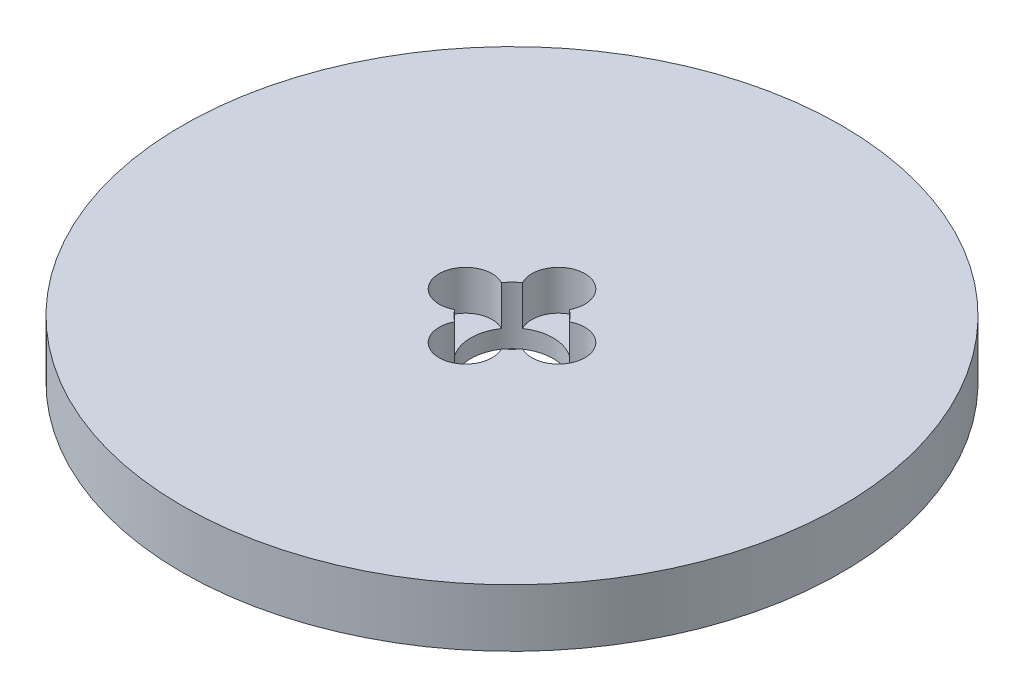
ISO-10303-21;
HEADER;
FILE_DESCRIPTION(('STEP AP214'),'2;1');
FILE_NAME('part.step','',(''),(''),'','','');
FILE_SCHEMA(('AUTOMOTIVE_DESIGN { 1 0 10303 214 1 1 1 1 }'));
ENDSEC;
DATA;
#1=APPLICATION_CONTEXT('core data for automotive mechanical design processes');
#2=APPLICATION_PROTOCOL_DEFINITION('international standard','automotive_design',2000,#1);
#3=PRODUCT_CONTEXT('',#1,'mechanical');
#4=PRODUCT('Part','Part','',(#3));
#5=PRODUCT_RELATED_PRODUCT_CATEGORY('part','',(#4));
#6=PRODUCT_DEFINITION_FORMATION('','',#4);
#7=PRODUCT_DEFINITION_CONTEXT('part definition',#1,'design');
#8=PRODUCT_DEFINITION('design','',#6,#7);
#9=PRODUCT_DEFINITION_SHAPE('','',#8);
#10=(LENGTH_UNIT() NAMED_UNIT(*) SI_UNIT(.MILLI.,.METRE.));
#11=(NAMED_UNIT(*) PLANE_ANGLE_UNIT() SI_UNIT($,.RADIAN.));
#12=(NAMED_UNIT(*) SI_UNIT($,.STERADIAN.) SOLID_ANGLE_UNIT());
#13=UNCERTAINTY_MEASURE_WITH_UNIT(LENGTH_MEASURE(1.E-05),#10,'distance_accuracy_value','');
#14=(GEOMETRIC_REPRESENTATION_CONTEXT(3) GLOBAL_UNCERTAINTY_ASSIGNED_CONTEXT((#13)) GLOBAL_UNIT_ASSIGNED_CONTEXT((#10,
#11,#12)) REPRESENTATION_CONTEXT('',''));
#15=CARTESIAN_POINT('',(0.,0.,0.));
#16=DIRECTION('',(0.,0.,1.));
#17=DIRECTION('',(1.,0.,0.));
#18=AXIS2_PLACEMENT_3D('',#15,#16,#17);
#19=CARTESIAN_POINT('',(0.,14.,0.));
#20=DIRECTION('',(0.,-1.,0.));
#21=DIRECTION('',(0.,0.,-1.));
#22=AXIS2_PLACEMENT_3D('',#19,#20,#21);
#23=CYLINDRICAL_SURFACE('',#22,80.);
#24=CARTESIAN_POINT('',(0.,14.,0.));
#25=DIRECTION('',(0.,1.,0.));
#26=DIRECTION('',(0.,0.,1.));
#27=AXIS2_PLACEMENT_3D('',#24,#25,#26);
#28=CIRCLE('',#27,80.);
#29=CARTESIAN_POINT('',(0.,14.,80.));
#30=VERTEX_POINT('',#29);
#31=EDGE_CURVE('E141',#30,#30,#28,.T.);
#32=ORIENTED_EDGE('',*,*,#31,.F.);
#33=EDGE_LOOP('',(#32));
#34=FACE_BOUND('',#33,.T.);
#35=CARTESIAN_POINT('',(0.,0.,0.));
#36=DIRECTION('',(0.,1.,0.));
#37=DIRECTION('',(0.,0.,1.));
#38=AXIS2_PLACEMENT_3D('',#35,#36,#37);
#39=CIRCLE('',#38,80.);
#40=CARTESIAN_POINT('',(0.,0.,80.));
#41=VERTEX_POINT('',#40);
#42=EDGE_CURVE('E135',#41,#41,#39,.T.);
#43=ORIENTED_EDGE('',*,*,#42,.T.);
#44=EDGE_LOOP('',(#43));
#45=FACE_BOUND('',#44,.T.);
#46=ADVANCED_FACE('F39',(#34,#45),#23,.T.);
#47=CARTESIAN_POINT('',(0.,14.,0.));
#48=DIRECTION('',(0.,1.,0.));
#49=DIRECTION('',(0.,0.,1.));
#50=AXIS2_PLACEMENT_3D('',#47,#48,#49);
#51=PLANE('',#50);
#52=CARTESIAN_POINT('',(11.2622057684001,14.,0.));
#53=DIRECTION('',(0.,1.,0.));
#54=DIRECTION('',(0.,0.,-1.));
#55=AXIS2_PLACEMENT_3D('',#52,#53,#54);
#56=CIRCLE('',#55,6.43016891628174);
#57=CARTESIAN_POINT('',(8.23507447352471,14.,5.67305459303026));
#58=VERTEX_POINT('',#57);
#59=CARTESIAN_POINT('',(8.23507447352471,14.,-5.67305459303026));
#60=VERTEX_POINT('',#59);
#61=EDGE_CURVE('E126',#58,#60,#56,.T.);
#62=ORIENTED_EDGE('',*,*,#61,.F.);
#63=CARTESIAN_POINT('',(0.,14.,0.));
#64=DIRECTION('',(0.,1.,0.));
#65=DIRECTION('',(0.,0.,1.));
#66=AXIS2_PLACEMENT_3D('',#63,#64,#65);
#67=CIRCLE('',#66,10.);
#68=CARTESIAN_POINT('',(5.67305459303029,14.,8.23507447352469));
#69=VERTEX_POINT('',#68);
#70=EDGE_CURVE('E121',#69,#58,#67,.T.);
#71=ORIENTED_EDGE('',*,*,#70,.F.);
#72=CARTESIAN_POINT('',(0.,14.,11.2622057684001));
#73=DIRECTION('',(0.,1.,0.));
#74=DIRECTION('',(1.,0.,0.));
#75=AXIS2_PLACEMENT_3D('',#72,#73,#74);
#76=CIRCLE('',#75,6.43016891628174);
#77=CARTESIAN_POINT('',(-5.67305459303023,14.,8.23507447352473));
#78=VERTEX_POINT('',#77);
#79=EDGE_CURVE('E105',#78,#69,#76,.T.);
#80=ORIENTED_EDGE('',*,*,#79,.F.);
#81=CARTESIAN_POINT('',(-8.23507447352471,14.,5.67305459303026));
#82=VERTEX_POINT('',#81);
#83=EDGE_CURVE('E129',#82,#78,#67,.T.);
#84=ORIENTED_EDGE('',*,*,#83,.F.);
#85=CARTESIAN_POINT('',(-11.2622057684001,14.,0.));
#86=DIRECTION('',(0.,1.,0.));
#87=DIRECTION('',(0.,0.,1.));
#88=AXIS2_PLACEMENT_3D('',#85,#86,#87);
#89=CIRCLE('',#88,6.43016891628174);
#90=CARTESIAN_POINT('',(-8.23507447352471,14.,-5.67305459303026));
#91=VERTEX_POINT('',#90);
#92=EDGE_CURVE('E140',#91,#82,#89,.T.);
#93=ORIENTED_EDGE('',*,*,#92,.F.);
#94=CARTESIAN_POINT('',(-5.67305459303034,14.,-8.23507447352465));
#95=VERTEX_POINT('',#94);
#96=EDGE_CURVE('E132',#95,#91,#67,.T.);
#97=ORIENTED_EDGE('',*,*,#96,.F.);
#98=CARTESIAN_POINT('',(-1.17965343823742E-13,14.,-11.2622057684001));
#99=DIRECTION('',(0.,1.,0.));
#100=DIRECTION('',(-1.,0.,0.));
#101=AXIS2_PLACEMENT_3D('',#98,#99,#100);
#102=CIRCLE('',#101,6.43016891628174);
#103=CARTESIAN_POINT('',(5.67305459303017,14.,-8.23507447352477));
#104=VERTEX_POINT('',#103);
#105=EDGE_CURVE('E226',#104,#95,#102,.T.);
#106=ORIENTED_EDGE('',*,*,#105,.F.);
#107=EDGE_CURVE('E128',#60,#104,#67,.T.);
#108=ORIENTED_EDGE('',*,*,#107,.F.);
#109=EDGE_LOOP('',(#62,#71,#80,#84,#93,#97,#106,#108));
#110=FACE_BOUND('',#109,.T.);
#111=ORIENTED_EDGE('',*,*,#31,.T.);
#112=EDGE_LOOP('',(#111));
#113=FACE_BOUND('',#112,.T.);
#114=ADVANCED_FACE('F124',(#110,#113),#51,.T.);
#115=CARTESIAN_POINT('',(0.,0.,0.));
#116=DIRECTION('',(0.,1.,0.));
#117=DIRECTION('',(0.,0.,1.));
#118=AXIS2_PLACEMENT_3D('',#115,#116,#117);
#119=PLANE('',#118);
#120=CARTESIAN_POINT('',(0.,0.,0.));
#121=DIRECTION('',(0.,1.,0.));
#122=DIRECTION('',(0.,0.,1.));
#123=AXIS2_PLACEMENT_3D('',#120,#121,#122);
#124=CIRCLE('',#123,10.);
#125=CARTESIAN_POINT('',(0.,0.,10.));
#126=VERTEX_POINT('',#125);
#127=EDGE_CURVE('E138',#126,#126,#124,.T.);
#128=ORIENTED_EDGE('',*,*,#127,.T.);
#129=EDGE_LOOP('',(#128));
#130=FACE_BOUND('',#129,.T.);
#131=ORIENTED_EDGE('',*,*,#42,.F.);
#132=EDGE_LOOP('',(#131));
#133=FACE_BOUND('',#132,.T.);
#134=ADVANCED_FACE('F186',(#130,#133),#119,.F.);
#135=CARTESIAN_POINT('',(0.,14.,0.));
#136=DIRECTION('',(0.,-1.,0.));
#137=DIRECTION('',(0.,0.,-1.));
#138=AXIS2_PLACEMENT_3D('',#135,#136,#137);
#139=CYLINDRICAL_SURFACE('',#138,10.);
#140=DIRECTION('',(0.,1.,0.));
#141=VECTOR('',#140,1.);
#142=CARTESIAN_POINT('',(8.23507447352471,9.17652201972072,5.67305459303026));
#143=LINE('',#142,#141);
#144=CARTESIAN_POINT('',(8.23507447352471,4.35304403944145,5.67305459303026));
#145=VERTEX_POINT('',#144);
#146=EDGE_CURVE('E11',#145,#58,#143,.T.);
#147=ORIENTED_EDGE('',*,*,#146,.F.);
#148=CARTESIAN_POINT('',(0.,4.35304403944145,0.));
#149=DIRECTION('',(0.,1.,0.));
#150=DIRECTION('',(0.,0.,1.));
#151=AXIS2_PLACEMENT_3D('',#148,#149,#150);
#152=CIRCLE('',#151,10.);
#153=CARTESIAN_POINT('',(8.23507447352471,4.35304403944145,-5.67305459303026));
#154=VERTEX_POINT('',#153);
#155=EDGE_CURVE('E167',#145,#154,#152,.T.);
#156=ORIENTED_EDGE('',*,*,#155,.T.);
#157=DIRECTION('',(0.,1.,0.));
#158=VECTOR('',#157,1.);
#159=CARTESIAN_POINT('',(8.23507447352471,9.17652201972072,-5.67305459303026));
#160=LINE('',#159,#158);
#161=EDGE_CURVE('E46',#60,#154,#160,.F.);
#162=ORIENTED_EDGE('',*,*,#161,.F.);
#163=ORIENTED_EDGE('',*,*,#107,.T.);
#164=DIRECTION('',(0.,1.,0.));
#165=VECTOR('',#164,1.);
#166=CARTESIAN_POINT('',(5.67305459303017,9.17652201972072,-8.23507447352477));
#167=LINE('',#166,#165);
#168=CARTESIAN_POINT('',(5.67305459303017,4.35304403944145,-8.23507447352477));
#169=VERTEX_POINT('',#168);
#170=EDGE_CURVE('E163',#169,#104,#167,.T.);
#171=ORIENTED_EDGE('',*,*,#170,.F.);
#172=CARTESIAN_POINT('',(0.,4.35304403944145,0.));
#173=DIRECTION('',(0.,1.,0.));
#174=DIRECTION('',(0.,0.,1.));
#175=AXIS2_PLACEMENT_3D('',#172,#173,#174);
#176=CIRCLE('',#175,10.);
#177=CARTESIAN_POINT('',(-5.67305459303034,4.35304403944145,-8.23507447352465));
#178=VERTEX_POINT('',#177);
#179=EDGE_CURVE('E157',#169,#178,#176,.T.);
#180=ORIENTED_EDGE('',*,*,#179,.T.);
#181=DIRECTION('',(0.,1.,0.));
#182=VECTOR('',#181,1.);
#183=CARTESIAN_POINT('',(-5.67305459303034,9.17652201972072,-8.23507447352465));
#184=LINE('',#183,#182);
#185=EDGE_CURVE('E165',#95,#178,#184,.F.);
#186=ORIENTED_EDGE('',*,*,#185,.F.);
#187=ORIENTED_EDGE('',*,*,#96,.T.);
#188=DIRECTION('',(0.,1.,0.));
#189=VECTOR('',#188,1.);
#190=CARTESIAN_POINT('',(-8.23507447352471,9.17652201972072,-5.67305459303026));
#191=LINE('',#190,#189);
#192=CARTESIAN_POINT('',(-8.23507447352471,4.35304403944145,-5.67305459303026));
#193=VERTEX_POINT('',#192);
#194=EDGE_CURVE('E152',#193,#91,#191,.T.);
#195=ORIENTED_EDGE('',*,*,#194,.F.);
#196=CARTESIAN_POINT('',(0.,4.35304403944145,0.));
#197=DIRECTION('',(0.,1.,0.));
#198=DIRECTION('',(0.,0.,1.));
#199=AXIS2_PLACEMENT_3D('',#196,#197,#198);
#200=CIRCLE('',#199,10.);
#201=CARTESIAN_POINT('',(-8.23507447352471,4.35304403944145,5.67305459303026));
#202=VERTEX_POINT('',#201);
#203=EDGE_CURVE('E148',#193,#202,#200,.T.);
#204=ORIENTED_EDGE('',*,*,#203,.T.);
#205=DIRECTION('',(0.,1.,0.));
#206=VECTOR('',#205,1.);
#207=CARTESIAN_POINT('',(-8.23507447352471,9.17652201972072,5.67305459303026));
#208=LINE('',#207,#206);
#209=EDGE_CURVE('E151',#82,#202,#208,.F.);
#210=ORIENTED_EDGE('',*,*,#209,.F.);
#211=ORIENTED_EDGE('',*,*,#83,.T.);
#212=DIRECTION('',(0.,1.,0.));
#213=VECTOR('',#212,1.);
#214=CARTESIAN_POINT('',(-5.67305459303023,9.17652201972072,8.23507447352473));
#215=LINE('',#214,#213);
#216=CARTESIAN_POINT('',(-5.67305459303023,4.35304403944145,8.23507447352473));
#217=VERTEX_POINT('',#216);
#218=EDGE_CURVE('E108',#217,#78,#215,.T.);
#219=ORIENTED_EDGE('',*,*,#218,.F.);
#220=CARTESIAN_POINT('',(0.,4.35304403944145,0.));
#221=DIRECTION('',(0.,1.,0.));
#222=DIRECTION('',(0.,0.,1.));
#223=AXIS2_PLACEMENT_3D('',#220,#221,#222);
#224=CIRCLE('',#223,10.);
#225=CARTESIAN_POINT('',(5.67305459303029,4.35304403944145,8.23507447352469));
#226=VERTEX_POINT('',#225);
#227=EDGE_CURVE('E125',#217,#226,#224,.T.);
#228=ORIENTED_EDGE('',*,*,#227,.T.);
#229=DIRECTION('',(0.,1.,0.));
#230=VECTOR('',#229,1.);
#231=CARTESIAN_POINT('',(5.67305459303029,9.17652201972072,8.23507447352469));
#232=LINE('',#231,#230);
#233=EDGE_CURVE('E106',#69,#226,#232,.F.);
#234=ORIENTED_EDGE('',*,*,#233,.F.);
#235=ORIENTED_EDGE('',*,*,#70,.T.);
#236=EDGE_LOOP('',(#147,#156,#162,#163,#171,#180,#186,#187,#195,#204,#210,#211,#219,#228,#234,#235));
#237=FACE_BOUND('',#236,.T.);
#238=ORIENTED_EDGE('',*,*,#127,.F.);
#239=EDGE_LOOP('',(#238));
#240=FACE_BOUND('',#239,.T.);
#241=ADVANCED_FACE('F118',(#237,#240),#139,.F.);
#242=CARTESIAN_POINT('',(-11.2622057684001,4.35304403944145,0.));
#243=DIRECTION('',(0.,1.,0.));
#244=DIRECTION('',(0.,0.,1.));
#245=AXIS2_PLACEMENT_3D('',#242,#243,#244);
#246=CYLINDRICAL_SURFACE('',#245,6.43016891628174);
#247=ORIENTED_EDGE('',*,*,#194,.T.);
#248=ORIENTED_EDGE('',*,*,#92,.T.);
#249=ORIENTED_EDGE('',*,*,#209,.T.);
#250=CARTESIAN_POINT('',(-11.2622057684001,4.35304403944145,0.));
#251=DIRECTION('',(0.,1.,0.));
#252=DIRECTION('',(0.,0.,1.));
#253=AXIS2_PLACEMENT_3D('',#250,#251,#252);
#254=CIRCLE('',#253,6.43016891628174);
#255=EDGE_CURVE('E142',#193,#202,#254,.T.);
#256=ORIENTED_EDGE('',*,*,#255,.F.);
#257=EDGE_LOOP('',(#247,#248,#249,#256));
#258=FACE_BOUND('',#257,.T.);
#259=ADVANCED_FACE('F197',(#258),#246,.F.);
#260=CARTESIAN_POINT('',(-11.2622057684001,4.35304403944145,0.));
#261=DIRECTION('',(0.,1.,0.));
#262=DIRECTION('',(0.,0.,1.));
#263=AXIS2_PLACEMENT_3D('',#260,#261,#262);
#264=PLANE('',#263);
#265=ORIENTED_EDGE('',*,*,#255,.T.);
#266=ORIENTED_EDGE('',*,*,#203,.F.);
#267=EDGE_LOOP('',(#265,#266));
#268=FACE_BOUND('',#267,.T.);
#269=ADVANCED_FACE('F203',(#268),#264,.T.);
#270=CARTESIAN_POINT('',(0.,4.35304403944145,11.2622057684001));
#271=DIRECTION('',(0.,1.,0.));
#272=DIRECTION('',(0.,0.,1.));
#273=AXIS2_PLACEMENT_3D('',#270,#271,#272);
#274=CYLINDRICAL_SURFACE('',#273,6.43016891628174);
#275=ORIENTED_EDGE('',*,*,#218,.T.);
#276=ORIENTED_EDGE('',*,*,#79,.T.);
#277=ORIENTED_EDGE('',*,*,#233,.T.);
#278=CARTESIAN_POINT('',(0.,4.35304403944145,11.2622057684001));
#279=DIRECTION('',(0.,1.,0.));
#280=DIRECTION('',(1.,0.,0.));
#281=AXIS2_PLACEMENT_3D('',#278,#279,#280);
#282=CIRCLE('',#281,6.43016891628174);
#283=EDGE_CURVE('E111',#217,#226,#282,.T.);
#284=ORIENTED_EDGE('',*,*,#283,.F.);
#285=EDGE_LOOP('',(#275,#276,#277,#284));
#286=FACE_BOUND('',#285,.T.);
#287=ADVANCED_FACE('F102',(#286),#274,.F.);
#288=CARTESIAN_POINT('',(0.,4.35304403944145,11.2622057684001));
#289=DIRECTION('',(0.,1.,0.));
#290=DIRECTION('',(1.,0.,0.));
#291=AXIS2_PLACEMENT_3D('',#288,#289,#290);
#292=PLANE('',#291);
#293=ORIENTED_EDGE('',*,*,#283,.T.);
#294=ORIENTED_EDGE('',*,*,#227,.F.);
#295=EDGE_LOOP('',(#293,#294));
#296=FACE_BOUND('',#295,.T.);
#297=ADVANCED_FACE('F208',(#296),#292,.T.);
#298=CARTESIAN_POINT('',(-1.17965343823742E-13,4.35304403944145,-11.2622057684001));
#299=DIRECTION('',(0.,1.,0.));
#300=DIRECTION('',(0.,0.,1.));
#301=AXIS2_PLACEMENT_3D('',#298,#299,#300);
#302=CYLINDRICAL_SURFACE('',#301,6.43016891628174);
#303=ORIENTED_EDGE('',*,*,#170,.T.);
#304=ORIENTED_EDGE('',*,*,#105,.T.);
#305=ORIENTED_EDGE('',*,*,#185,.T.);
#306=CARTESIAN_POINT('',(-1.17965343823742E-13,4.35304403944145,-11.2622057684001));
#307=DIRECTION('',(0.,1.,0.));
#308=DIRECTION('',(-1.,0.,0.));
#309=AXIS2_PLACEMENT_3D('',#306,#307,#308);
#310=CIRCLE('',#309,6.43016891628174);
#311=EDGE_CURVE('E56',#169,#178,#310,.T.);
#312=ORIENTED_EDGE('',*,*,#311,.F.);
#313=EDGE_LOOP('',(#303,#304,#305,#312));
#314=FACE_BOUND('',#313,.T.);
#315=ADVANCED_FACE('F209',(#314),#302,.F.);
#316=CARTESIAN_POINT('',(-1.17965343823742E-13,4.35304403944145,-11.2622057684001));
#317=DIRECTION('',(0.,1.,0.));
#318=DIRECTION('',(-1.,0.,0.));
#319=AXIS2_PLACEMENT_3D('',#316,#317,#318);
#320=PLANE('',#319);
#321=ORIENTED_EDGE('',*,*,#311,.T.);
#322=ORIENTED_EDGE('',*,*,#179,.F.);
#323=EDGE_LOOP('',(#321,#322));
#324=FACE_BOUND('',#323,.T.);
#325=ADVANCED_FACE('F180',(#324),#320,.T.);
#326=CARTESIAN_POINT('',(11.2622057684001,4.35304403944145,0.));
#327=DIRECTION('',(0.,1.,0.));
#328=DIRECTION('',(0.,0.,1.));
#329=AXIS2_PLACEMENT_3D('',#326,#327,#328);
#330=CYLINDRICAL_SURFACE('',#329,6.43016891628174);
#331=ORIENTED_EDGE('',*,*,#146,.T.);
#332=ORIENTED_EDGE('',*,*,#61,.T.);
#333=ORIENTED_EDGE('',*,*,#161,.T.);
#334=CARTESIAN_POINT('',(11.2622057684001,4.35304403944145,0.));
#335=DIRECTION('',(0.,1.,0.));
#336=DIRECTION('',(0.,0.,-1.));
#337=AXIS2_PLACEMENT_3D('',#334,#335,#336);
#338=CIRCLE('',#337,6.43016891628174);
#339=EDGE_CURVE('E55',#145,#154,#338,.T.);
#340=ORIENTED_EDGE('',*,*,#339,.F.);
#341=EDGE_LOOP('',(#331,#332,#333,#340));
#342=FACE_BOUND('',#341,.T.);
#343=ADVANCED_FACE('F168',(#342),#330,.F.);
#344=CARTESIAN_POINT('',(11.2622057684001,4.35304403944145,0.));
#345=DIRECTION('',(0.,1.,0.));
#346=DIRECTION('',(0.,0.,-1.));
#347=AXIS2_PLACEMENT_3D('',#344,#345,#346);
#348=PLANE('',#347);
#349=ORIENTED_EDGE('',*,*,#339,.T.);
#350=ORIENTED_EDGE('',*,*,#155,.F.);
#351=EDGE_LOOP('',(#349,#350));
#352=FACE_BOUND('',#351,.T.);
#353=ADVANCED_FACE('F171',(#352),#348,.T.);
#354=CLOSED_SHELL('',(#46,#114,#134,#241,#259,#269,#287,#297,#315,#325,#343,#353));
#355=MANIFOLD_SOLID_BREP('B2',#354);
#356=ADVANCED_BREP_SHAPE_REPRESENTATION('',(#18,#355),#14);
#357=SHAPE_DEFINITION_REPRESENTATION(#9,#356);
ENDSEC;
END-ISO-10303-21;
